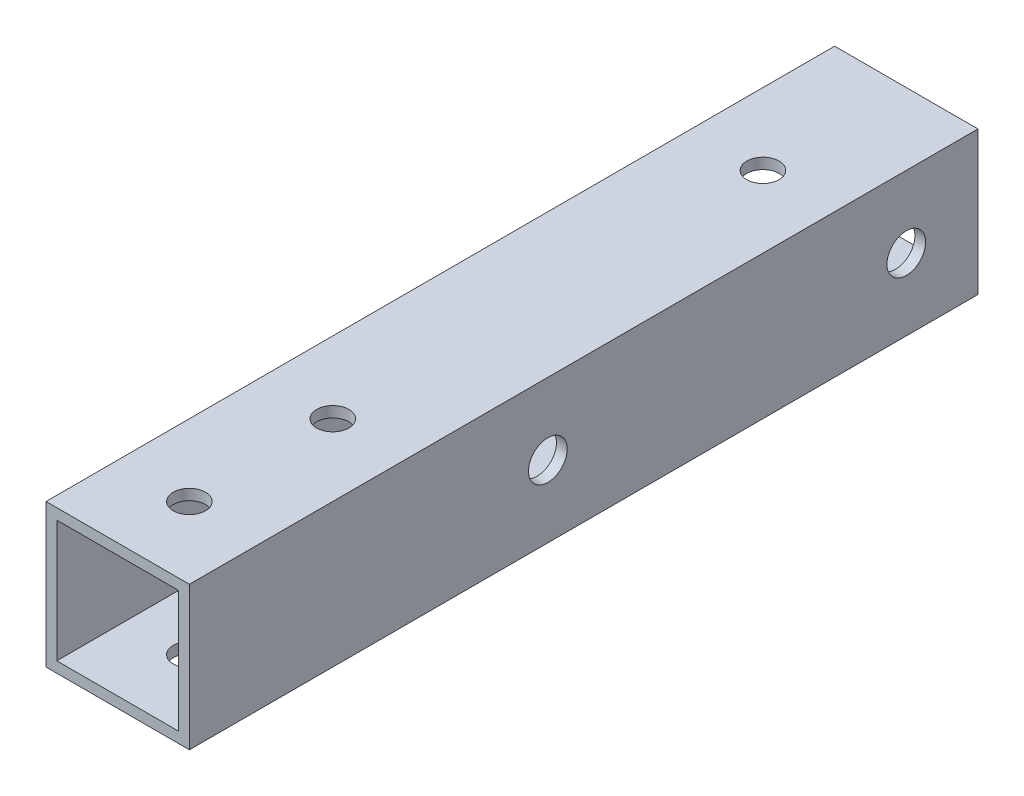
ISO-10303-21;
HEADER;
FILE_DESCRIPTION(('STEP AP214'),'2;1');
FILE_NAME('part.step','',(''),(''),'','','');
FILE_SCHEMA(('AUTOMOTIVE_DESIGN { 1 0 10303 214 1 1 1 1 }'));
ENDSEC;
DATA;
#1=APPLICATION_CONTEXT('core data for automotive mechanical design processes');
#2=APPLICATION_PROTOCOL_DEFINITION('international standard','automotive_design',2000,#1);
#3=PRODUCT_CONTEXT('',#1,'mechanical');
#4=PRODUCT('Part','Part','',(#3));
#5=PRODUCT_RELATED_PRODUCT_CATEGORY('part','',(#4));
#6=PRODUCT_DEFINITION_FORMATION('','',#4);
#7=PRODUCT_DEFINITION_CONTEXT('part definition',#1,'design');
#8=PRODUCT_DEFINITION('design','',#6,#7);
#9=PRODUCT_DEFINITION_SHAPE('','',#8);
#10=(LENGTH_UNIT() NAMED_UNIT(*) SI_UNIT(.MILLI.,.METRE.));
#11=(NAMED_UNIT(*) PLANE_ANGLE_UNIT() SI_UNIT($,.RADIAN.));
#12=(NAMED_UNIT(*) SI_UNIT($,.STERADIAN.) SOLID_ANGLE_UNIT());
#13=UNCERTAINTY_MEASURE_WITH_UNIT(LENGTH_MEASURE(1.E-05),#10,'distance_accuracy_value','');
#14=(GEOMETRIC_REPRESENTATION_CONTEXT(3) GLOBAL_UNCERTAINTY_ASSIGNED_CONTEXT((#13)) GLOBAL_UNIT_ASSIGNED_CONTEXT((#10,
#11,#12)) REPRESENTATION_CONTEXT('',''));
#15=CARTESIAN_POINT('',(0.,0.,0.));
#16=DIRECTION('',(0.,0.,1.));
#17=DIRECTION('',(1.,0.,0.));
#18=AXIS2_PLACEMENT_3D('',#15,#16,#17);
#19=CARTESIAN_POINT('',(0.,0.,110.));
#20=DIRECTION('',(0.,0.,-1.));
#21=DIRECTION('',(-1.,0.,0.));
#22=AXIS2_PLACEMENT_3D('',#19,#20,#21);
#23=PLANE('',#22);
#24=DIRECTION('',(0.,1.,0.));
#25=VECTOR('',#24,1.);
#26=CARTESIAN_POINT('',(10.,-10.,110.));
#27=LINE('',#26,#25);
#28=CARTESIAN_POINT('',(10.,-10.,110.));
#29=VERTEX_POINT('',#28);
#30=CARTESIAN_POINT('',(10.,10.,110.));
#31=VERTEX_POINT('',#30);
#32=EDGE_CURVE('E146',#29,#31,#27,.T.);
#33=ORIENTED_EDGE('',*,*,#32,.T.);
#34=DIRECTION('',(-1.,0.,0.));
#35=VECTOR('',#34,1.);
#36=CARTESIAN_POINT('',(-10.,10.,110.));
#37=LINE('',#36,#35);
#38=CARTESIAN_POINT('',(-10.,10.,110.));
#39=VERTEX_POINT('',#38);
#40=EDGE_CURVE('E149',#31,#39,#37,.T.);
#41=ORIENTED_EDGE('',*,*,#40,.T.);
#42=DIRECTION('',(0.,-1.,0.));
#43=VECTOR('',#42,1.);
#44=CARTESIAN_POINT('',(-10.,-10.,110.));
#45=LINE('',#44,#43);
#46=CARTESIAN_POINT('',(-10.,-10.,110.));
#47=VERTEX_POINT('',#46);
#48=EDGE_CURVE('E152',#39,#47,#45,.T.);
#49=ORIENTED_EDGE('',*,*,#48,.T.);
#50=DIRECTION('',(1.,0.,0.));
#51=VECTOR('',#50,1.);
#52=CARTESIAN_POINT('',(-10.,-10.,110.));
#53=LINE('',#52,#51);
#54=EDGE_CURVE('E154',#47,#29,#53,.T.);
#55=ORIENTED_EDGE('',*,*,#54,.T.);
#56=EDGE_LOOP('',(#33,#41,#49,#55));
#57=FACE_BOUND('',#56,.T.);
#58=DIRECTION('',(0.,1.,0.));
#59=VECTOR('',#58,1.);
#60=CARTESIAN_POINT('',(8.5,-8.5,110.));
#61=LINE('',#60,#59);
#62=CARTESIAN_POINT('',(8.5,-8.5,110.));
#63=VERTEX_POINT('',#62);
#64=CARTESIAN_POINT('',(8.5,8.5,110.));
#65=VERTEX_POINT('',#64);
#66=EDGE_CURVE('E108',#63,#65,#61,.T.);
#67=ORIENTED_EDGE('',*,*,#66,.F.);
#68=DIRECTION('',(1.,0.,0.));
#69=VECTOR('',#68,1.);
#70=CARTESIAN_POINT('',(-8.5,-8.5,110.));
#71=LINE('',#70,#69);
#72=CARTESIAN_POINT('',(-8.5,-8.5,110.));
#73=VERTEX_POINT('',#72);
#74=EDGE_CURVE('E130',#73,#63,#71,.T.);
#75=ORIENTED_EDGE('',*,*,#74,.F.);
#76=DIRECTION('',(0.,-1.,0.));
#77=VECTOR('',#76,1.);
#78=CARTESIAN_POINT('',(-8.5,-8.5,110.));
#79=LINE('',#78,#77);
#80=CARTESIAN_POINT('',(-8.5,8.5,110.));
#81=VERTEX_POINT('',#80);
#82=EDGE_CURVE('E128',#81,#73,#79,.T.);
#83=ORIENTED_EDGE('',*,*,#82,.F.);
#84=DIRECTION('',(-1.,0.,0.));
#85=VECTOR('',#84,1.);
#86=CARTESIAN_POINT('',(-8.5,8.5,110.));
#87=LINE('',#86,#85);
#88=EDGE_CURVE('E116',#65,#81,#87,.T.);
#89=ORIENTED_EDGE('',*,*,#88,.F.);
#90=EDGE_LOOP('',(#67,#75,#83,#89));
#91=FACE_BOUND('',#90,.T.);
#92=ADVANCED_FACE('F41',(#57,#91),#23,.F.);
#93=CARTESIAN_POINT('',(0.,0.,0.));
#94=DIRECTION('',(0.,0.,-1.));
#95=DIRECTION('',(-1.,0.,0.));
#96=AXIS2_PLACEMENT_3D('',#93,#94,#95);
#97=PLANE('',#96);
#98=DIRECTION('',(0.,1.,0.));
#99=VECTOR('',#98,1.);
#100=CARTESIAN_POINT('',(10.,-10.,0.));
#101=LINE('',#100,#99);
#102=CARTESIAN_POINT('',(10.,-10.,0.));
#103=VERTEX_POINT('',#102);
#104=CARTESIAN_POINT('',(10.,10.,0.));
#105=VERTEX_POINT('',#104);
#106=EDGE_CURVE('E124',#103,#105,#101,.T.);
#107=ORIENTED_EDGE('',*,*,#106,.F.);
#108=DIRECTION('',(1.,0.,0.));
#109=VECTOR('',#108,1.);
#110=CARTESIAN_POINT('',(-10.,-10.,0.));
#111=LINE('',#110,#109);
#112=CARTESIAN_POINT('',(-10.,-10.,0.));
#113=VERTEX_POINT('',#112);
#114=EDGE_CURVE('E150',#113,#103,#111,.T.);
#115=ORIENTED_EDGE('',*,*,#114,.F.);
#116=DIRECTION('',(0.,-1.,0.));
#117=VECTOR('',#116,1.);
#118=CARTESIAN_POINT('',(-10.,-10.,0.));
#119=LINE('',#118,#117);
#120=CARTESIAN_POINT('',(-10.,10.,0.));
#121=VERTEX_POINT('',#120);
#122=EDGE_CURVE('E161',#121,#113,#119,.T.);
#123=ORIENTED_EDGE('',*,*,#122,.F.);
#124=DIRECTION('',(-1.,0.,0.));
#125=VECTOR('',#124,1.);
#126=CARTESIAN_POINT('',(-10.,10.,0.));
#127=LINE('',#126,#125);
#128=EDGE_CURVE('E159',#105,#121,#127,.T.);
#129=ORIENTED_EDGE('',*,*,#128,.F.);
#130=EDGE_LOOP('',(#107,#115,#123,#129));
#131=FACE_BOUND('',#130,.T.);
#132=DIRECTION('',(1.,0.,0.));
#133=VECTOR('',#132,1.);
#134=CARTESIAN_POINT('',(-8.5,-8.5,0.));
#135=LINE('',#134,#133);
#136=CARTESIAN_POINT('',(-8.5,-8.5,0.));
#137=VERTEX_POINT('',#136);
#138=CARTESIAN_POINT('',(8.5,-8.5,0.));
#139=VERTEX_POINT('',#138);
#140=EDGE_CURVE('E117',#137,#139,#135,.T.);
#141=ORIENTED_EDGE('',*,*,#140,.T.);
#142=DIRECTION('',(0.,1.,0.));
#143=VECTOR('',#142,1.);
#144=CARTESIAN_POINT('',(8.5,-8.5,0.));
#145=LINE('',#144,#143);
#146=CARTESIAN_POINT('',(8.5,8.5,0.));
#147=VERTEX_POINT('',#146);
#148=EDGE_CURVE('E66',#139,#147,#145,.T.);
#149=ORIENTED_EDGE('',*,*,#148,.T.);
#150=DIRECTION('',(-1.,0.,0.));
#151=VECTOR('',#150,1.);
#152=CARTESIAN_POINT('',(-8.5,8.5,0.));
#153=LINE('',#152,#151);
#154=CARTESIAN_POINT('',(-8.5,8.5,0.));
#155=VERTEX_POINT('',#154);
#156=EDGE_CURVE('E123',#147,#155,#153,.T.);
#157=ORIENTED_EDGE('',*,*,#156,.T.);
#158=DIRECTION('',(0.,-1.,0.));
#159=VECTOR('',#158,1.);
#160=CARTESIAN_POINT('',(-8.5,-8.5,0.));
#161=LINE('',#160,#159);
#162=EDGE_CURVE('E138',#155,#137,#161,.T.);
#163=ORIENTED_EDGE('',*,*,#162,.T.);
#164=EDGE_LOOP('',(#141,#149,#157,#163));
#165=FACE_BOUND('',#164,.T.);
#166=ADVANCED_FACE('F250',(#131,#165),#97,.T.);
#167=CARTESIAN_POINT('',(10.,-10.,110.));
#168=DIRECTION('',(-1.,0.,0.));
#169=DIRECTION('',(0.,0.,1.));
#170=AXIS2_PLACEMENT_3D('',#167,#168,#169);
#171=PLANE('',#170);
#172=CARTESIAN_POINT('',(10.,0.,10.));
#173=DIRECTION('',(1.,0.,0.));
#174=DIRECTION('',(0.,0.,-1.));
#175=AXIS2_PLACEMENT_3D('',#172,#173,#174);
#176=CIRCLE('',#175,2.7);
#177=CARTESIAN_POINT('',(10.,0.,7.3));
#178=VERTEX_POINT('',#177);
#179=EDGE_CURVE('E221',#178,#178,#176,.T.);
#180=ORIENTED_EDGE('',*,*,#179,.F.);
#181=EDGE_LOOP('',(#180));
#182=FACE_BOUND('',#181,.T.);
#183=CARTESIAN_POINT('',(10.,0.,60.));
#184=DIRECTION('',(1.,0.,0.));
#185=DIRECTION('',(0.,0.,-1.));
#186=AXIS2_PLACEMENT_3D('',#183,#184,#185);
#187=CIRCLE('',#186,2.7);
#188=CARTESIAN_POINT('',(10.,0.,57.3));
#189=VERTEX_POINT('',#188);
#190=EDGE_CURVE('E220',#189,#189,#187,.T.);
#191=ORIENTED_EDGE('',*,*,#190,.F.);
#192=EDGE_LOOP('',(#191));
#193=FACE_BOUND('',#192,.T.);
#194=ORIENTED_EDGE('',*,*,#106,.T.);
#195=DIRECTION('',(0.,0.,-1.));
#196=VECTOR('',#195,1.);
#197=CARTESIAN_POINT('',(10.,10.,110.));
#198=LINE('',#197,#196);
#199=EDGE_CURVE('E11',#31,#105,#198,.T.);
#200=ORIENTED_EDGE('',*,*,#199,.F.);
#201=ORIENTED_EDGE('',*,*,#32,.F.);
#202=DIRECTION('',(0.,0.,-1.));
#203=VECTOR('',#202,1.);
#204=CARTESIAN_POINT('',(10.,-10.,110.));
#205=LINE('',#204,#203);
#206=EDGE_CURVE('E156',#29,#103,#205,.T.);
#207=ORIENTED_EDGE('',*,*,#206,.T.);
#208=EDGE_LOOP('',(#194,#200,#201,#207));
#209=FACE_BOUND('',#208,.T.);
#210=ADVANCED_FACE('F43',(#182,#193,#209),#171,.F.);
#211=CARTESIAN_POINT('',(-10.,10.,110.));
#212=DIRECTION('',(0.,-1.,0.));
#213=DIRECTION('',(0.,0.,-1.));
#214=AXIS2_PLACEMENT_3D('',#211,#212,#213);
#215=PLANE('',#214);
#216=CARTESIAN_POINT('',(0.,10.,100.));
#217=DIRECTION('',(0.,1.,0.));
#218=DIRECTION('',(0.,0.,1.));
#219=AXIS2_PLACEMENT_3D('',#216,#217,#218);
#220=CIRCLE('',#219,2.25);
#221=CARTESIAN_POINT('',(0.,10.,102.25));
#222=VERTEX_POINT('',#221);
#223=EDGE_CURVE('E203',#222,#222,#220,.T.);
#224=ORIENTED_EDGE('',*,*,#223,.F.);
#225=EDGE_LOOP('',(#224));
#226=FACE_BOUND('',#225,.T.);
#227=CARTESIAN_POINT('',(0.,10.,80.));
#228=DIRECTION('',(0.,1.,0.));
#229=DIRECTION('',(0.,0.,1.));
#230=AXIS2_PLACEMENT_3D('',#227,#228,#229);
#231=CIRCLE('',#230,2.25);
#232=CARTESIAN_POINT('',(0.,10.,82.25));
#233=VERTEX_POINT('',#232);
#234=EDGE_CURVE('E206',#233,#233,#231,.T.);
#235=ORIENTED_EDGE('',*,*,#234,.F.);
#236=EDGE_LOOP('',(#235));
#237=FACE_BOUND('',#236,.T.);
#238=CARTESIAN_POINT('',(-2.06718869533235E-13,10.,20.));
#239=DIRECTION('',(0.,1.,0.));
#240=DIRECTION('',(0.,0.,1.));
#241=AXIS2_PLACEMENT_3D('',#238,#239,#240);
#242=CIRCLE('',#241,2.25);
#243=CARTESIAN_POINT('',(-2.06718869533235E-13,10.,22.25));
#244=VERTEX_POINT('',#243);
#245=EDGE_CURVE('E182',#244,#244,#242,.T.);
#246=ORIENTED_EDGE('',*,*,#245,.F.);
#247=EDGE_LOOP('',(#246));
#248=FACE_BOUND('',#247,.T.);
#249=ORIENTED_EDGE('',*,*,#128,.T.);
#250=DIRECTION('',(0.,0.,-1.));
#251=VECTOR('',#250,1.);
#252=CARTESIAN_POINT('',(-10.,10.,110.));
#253=LINE('',#252,#251);
#254=EDGE_CURVE('E50',#39,#121,#253,.T.);
#255=ORIENTED_EDGE('',*,*,#254,.F.);
#256=ORIENTED_EDGE('',*,*,#40,.F.);
#257=ORIENTED_EDGE('',*,*,#199,.T.);
#258=EDGE_LOOP('',(#249,#255,#256,#257));
#259=FACE_BOUND('',#258,.T.);
#260=ADVANCED_FACE('F249',(#226,#237,#248,#259),#215,.F.);
#261=CARTESIAN_POINT('',(-10.,-10.,110.));
#262=DIRECTION('',(1.,0.,0.));
#263=DIRECTION('',(0.,0.,-1.));
#264=AXIS2_PLACEMENT_3D('',#261,#262,#263);
#265=PLANE('',#264);
#266=CARTESIAN_POINT('',(-10.,0.,10.));
#267=DIRECTION('',(-1.,0.,0.));
#268=DIRECTION('',(0.,0.,1.));
#269=AXIS2_PLACEMENT_3D('',#266,#267,#268);
#270=CIRCLE('',#269,5.);
#271=CARTESIAN_POINT('',(-10.,0.,15.));
#272=VERTEX_POINT('',#271);
#273=EDGE_CURVE('E186',#272,#272,#270,.T.);
#274=ORIENTED_EDGE('',*,*,#273,.F.);
#275=EDGE_LOOP('',(#274));
#276=FACE_BOUND('',#275,.T.);
#277=CARTESIAN_POINT('',(-10.,0.,60.));
#278=DIRECTION('',(-1.,0.,0.));
#279=DIRECTION('',(0.,0.,1.));
#280=AXIS2_PLACEMENT_3D('',#277,#278,#279);
#281=CIRCLE('',#280,5.);
#282=CARTESIAN_POINT('',(-10.,0.,65.));
#283=VERTEX_POINT('',#282);
#284=EDGE_CURVE('E191',#283,#283,#281,.T.);
#285=ORIENTED_EDGE('',*,*,#284,.F.);
#286=EDGE_LOOP('',(#285));
#287=FACE_BOUND('',#286,.T.);
#288=ORIENTED_EDGE('',*,*,#122,.T.);
#289=DIRECTION('',(0.,0.,-1.));
#290=VECTOR('',#289,1.);
#291=CARTESIAN_POINT('',(-10.,-10.,110.));
#292=LINE('',#291,#290);
#293=EDGE_CURVE('E166',#47,#113,#292,.T.);
#294=ORIENTED_EDGE('',*,*,#293,.F.);
#295=ORIENTED_EDGE('',*,*,#48,.F.);
#296=ORIENTED_EDGE('',*,*,#254,.T.);
#297=EDGE_LOOP('',(#288,#294,#295,#296));
#298=FACE_BOUND('',#297,.T.);
#299=ADVANCED_FACE('F268',(#276,#287,#298),#265,.F.);
#300=CARTESIAN_POINT('',(-10.,-10.,110.));
#301=DIRECTION('',(0.,1.,0.));
#302=DIRECTION('',(0.,0.,1.));
#303=AXIS2_PLACEMENT_3D('',#300,#301,#302);
#304=PLANE('',#303);
#305=CARTESIAN_POINT('',(-5.38458166943201E-12,-10.,20.0000000000006));
#306=DIRECTION('',(0.,-1.,0.));
#307=DIRECTION('',(0.,0.,-1.));
#308=AXIS2_PLACEMENT_3D('',#305,#306,#307);
#309=CIRCLE('',#308,5.);
#310=CARTESIAN_POINT('',(-5.38458166943201E-12,-10.,15.0000000000006));
#311=VERTEX_POINT('',#310);
#312=EDGE_CURVE('E183',#311,#311,#309,.T.);
#313=ORIENTED_EDGE('',*,*,#312,.F.);
#314=EDGE_LOOP('',(#313));
#315=FACE_BOUND('',#314,.T.);
#316=CARTESIAN_POINT('',(0.,-10.,100.));
#317=DIRECTION('',(0.,1.,0.));
#318=DIRECTION('',(0.,0.,1.));
#319=AXIS2_PLACEMENT_3D('',#316,#317,#318);
#320=CIRCLE('',#319,2.25);
#321=CARTESIAN_POINT('',(0.,-10.,102.25));
#322=VERTEX_POINT('',#321);
#323=EDGE_CURVE('E200',#322,#322,#320,.T.);
#324=ORIENTED_EDGE('',*,*,#323,.T.);
#325=EDGE_LOOP('',(#324));
#326=FACE_BOUND('',#325,.T.);
#327=CARTESIAN_POINT('',(0.,-10.,80.));
#328=DIRECTION('',(0.,1.,0.));
#329=DIRECTION('',(0.,0.,1.));
#330=AXIS2_PLACEMENT_3D('',#327,#328,#329);
#331=CIRCLE('',#330,2.25);
#332=CARTESIAN_POINT('',(0.,-10.,82.25));
#333=VERTEX_POINT('',#332);
#334=EDGE_CURVE('E209',#333,#333,#331,.T.);
#335=ORIENTED_EDGE('',*,*,#334,.T.);
#336=EDGE_LOOP('',(#335));
#337=FACE_BOUND('',#336,.T.);
#338=ORIENTED_EDGE('',*,*,#114,.T.);
#339=ORIENTED_EDGE('',*,*,#206,.F.);
#340=ORIENTED_EDGE('',*,*,#54,.F.);
#341=ORIENTED_EDGE('',*,*,#293,.T.);
#342=EDGE_LOOP('',(#338,#339,#340,#341));
#343=FACE_BOUND('',#342,.T.);
#344=ADVANCED_FACE('F236',(#315,#326,#337,#343),#304,.F.);
#345=CARTESIAN_POINT('',(8.5,-8.5,110.));
#346=DIRECTION('',(-1.,0.,0.));
#347=DIRECTION('',(0.,0.,1.));
#348=AXIS2_PLACEMENT_3D('',#345,#346,#347);
#349=PLANE('',#348);
#350=CARTESIAN_POINT('',(8.5,0.,10.));
#351=DIRECTION('',(-1.,0.,0.));
#352=DIRECTION('',(0.,0.,1.));
#353=AXIS2_PLACEMENT_3D('',#350,#351,#352);
#354=CIRCLE('',#353,2.7);
#355=CARTESIAN_POINT('',(8.5,0.,12.7));
#356=VERTEX_POINT('',#355);
#357=EDGE_CURVE('E136',#356,#356,#354,.T.);
#358=ORIENTED_EDGE('',*,*,#357,.F.);
#359=EDGE_LOOP('',(#358));
#360=FACE_BOUND('',#359,.T.);
#361=CARTESIAN_POINT('',(8.5,0.,60.));
#362=DIRECTION('',(-1.,0.,0.));
#363=DIRECTION('',(0.,0.,1.));
#364=AXIS2_PLACEMENT_3D('',#361,#362,#363);
#365=CIRCLE('',#364,2.7);
#366=CARTESIAN_POINT('',(8.5,0.,62.7));
#367=VERTEX_POINT('',#366);
#368=EDGE_CURVE('E224',#367,#367,#365,.T.);
#369=ORIENTED_EDGE('',*,*,#368,.F.);
#370=EDGE_LOOP('',(#369));
#371=FACE_BOUND('',#370,.T.);
#372=ORIENTED_EDGE('',*,*,#148,.F.);
#373=DIRECTION('',(0.,0.,-1.));
#374=VECTOR('',#373,1.);
#375=CARTESIAN_POINT('',(8.5,-8.5,110.));
#376=LINE('',#375,#374);
#377=EDGE_CURVE('E112',#63,#139,#376,.T.);
#378=ORIENTED_EDGE('',*,*,#377,.F.);
#379=ORIENTED_EDGE('',*,*,#66,.T.);
#380=DIRECTION('',(0.,0.,-1.));
#381=VECTOR('',#380,1.);
#382=CARTESIAN_POINT('',(8.5,8.5,110.));
#383=LINE('',#382,#381);
#384=EDGE_CURVE('E111',#65,#147,#383,.T.);
#385=ORIENTED_EDGE('',*,*,#384,.T.);
#386=EDGE_LOOP('',(#372,#378,#379,#385));
#387=FACE_BOUND('',#386,.T.);
#388=ADVANCED_FACE('F110',(#360,#371,#387),#349,.T.);
#389=CARTESIAN_POINT('',(-8.5,8.5,110.));
#390=DIRECTION('',(0.,-1.,0.));
#391=DIRECTION('',(0.,0.,-1.));
#392=AXIS2_PLACEMENT_3D('',#389,#390,#391);
#393=PLANE('',#392);
#394=CARTESIAN_POINT('',(0.,8.5,100.));
#395=DIRECTION('',(0.,-1.,0.));
#396=DIRECTION('',(0.,0.,-1.));
#397=AXIS2_PLACEMENT_3D('',#394,#395,#396);
#398=CIRCLE('',#397,2.25);
#399=CARTESIAN_POINT('',(0.,8.5,97.75));
#400=VERTEX_POINT('',#399);
#401=EDGE_CURVE('E179',#400,#400,#398,.T.);
#402=ORIENTED_EDGE('',*,*,#401,.F.);
#403=EDGE_LOOP('',(#402));
#404=FACE_BOUND('',#403,.T.);
#405=CARTESIAN_POINT('',(0.,8.5,80.));
#406=DIRECTION('',(0.,-1.,0.));
#407=DIRECTION('',(0.,0.,-1.));
#408=AXIS2_PLACEMENT_3D('',#405,#406,#407);
#409=CIRCLE('',#408,2.25);
#410=CARTESIAN_POINT('',(0.,8.5,77.75));
#411=VERTEX_POINT('',#410);
#412=EDGE_CURVE('E174',#411,#411,#409,.T.);
#413=ORIENTED_EDGE('',*,*,#412,.F.);
#414=EDGE_LOOP('',(#413));
#415=FACE_BOUND('',#414,.T.);
#416=CARTESIAN_POINT('',(-2.06718869533235E-13,8.5,20.));
#417=DIRECTION('',(0.,-1.,0.));
#418=DIRECTION('',(0.,0.,-1.));
#419=AXIS2_PLACEMENT_3D('',#416,#417,#418);
#420=CIRCLE('',#419,2.25);
#421=CARTESIAN_POINT('',(-2.06718869533235E-13,8.5,17.75));
#422=VERTEX_POINT('',#421);
#423=EDGE_CURVE('E175',#422,#422,#420,.T.);
#424=ORIENTED_EDGE('',*,*,#423,.F.);
#425=EDGE_LOOP('',(#424));
#426=FACE_BOUND('',#425,.T.);
#427=ORIENTED_EDGE('',*,*,#156,.F.);
#428=ORIENTED_EDGE('',*,*,#384,.F.);
#429=ORIENTED_EDGE('',*,*,#88,.T.);
#430=DIRECTION('',(0.,0.,-1.));
#431=VECTOR('',#430,1.);
#432=CARTESIAN_POINT('',(-8.5,8.5,110.));
#433=LINE('',#432,#431);
#434=EDGE_CURVE('E125',#81,#155,#433,.T.);
#435=ORIENTED_EDGE('',*,*,#434,.T.);
#436=EDGE_LOOP('',(#427,#428,#429,#435));
#437=FACE_BOUND('',#436,.T.);
#438=ADVANCED_FACE('F120',(#404,#415,#426,#437),#393,.T.);
#439=CARTESIAN_POINT('',(-8.5,-8.5,110.));
#440=DIRECTION('',(1.,0.,0.));
#441=DIRECTION('',(0.,0.,-1.));
#442=AXIS2_PLACEMENT_3D('',#439,#440,#441);
#443=PLANE('',#442);
#444=CARTESIAN_POINT('',(-8.5,0.,10.));
#445=DIRECTION('',(1.,0.,0.));
#446=DIRECTION('',(0.,0.,-1.));
#447=AXIS2_PLACEMENT_3D('',#444,#445,#446);
#448=CIRCLE('',#447,5.);
#449=CARTESIAN_POINT('',(-8.5,0.,5.));
#450=VERTEX_POINT('',#449);
#451=EDGE_CURVE('E45',#450,#450,#448,.T.);
#452=ORIENTED_EDGE('',*,*,#451,.F.);
#453=EDGE_LOOP('',(#452));
#454=FACE_BOUND('',#453,.T.);
#455=CARTESIAN_POINT('',(-8.5,0.,60.));
#456=DIRECTION('',(1.,0.,0.));
#457=DIRECTION('',(0.,0.,-1.));
#458=AXIS2_PLACEMENT_3D('',#455,#456,#457);
#459=CIRCLE('',#458,5.);
#460=CARTESIAN_POINT('',(-8.5,0.,55.));
#461=VERTEX_POINT('',#460);
#462=EDGE_CURVE('E184',#461,#461,#459,.T.);
#463=ORIENTED_EDGE('',*,*,#462,.F.);
#464=EDGE_LOOP('',(#463));
#465=FACE_BOUND('',#464,.T.);
#466=ORIENTED_EDGE('',*,*,#162,.F.);
#467=ORIENTED_EDGE('',*,*,#434,.F.);
#468=ORIENTED_EDGE('',*,*,#82,.T.);
#469=DIRECTION('',(0.,0.,-1.));
#470=VECTOR('',#469,1.);
#471=CARTESIAN_POINT('',(-8.5,-8.5,110.));
#472=LINE('',#471,#470);
#473=EDGE_CURVE('E58',#73,#137,#472,.T.);
#474=ORIENTED_EDGE('',*,*,#473,.T.);
#475=EDGE_LOOP('',(#466,#467,#468,#474));
#476=FACE_BOUND('',#475,.T.);
#477=ADVANCED_FACE('F291',(#454,#465,#476),#443,.T.);
#478=CARTESIAN_POINT('',(-8.5,-8.5,110.));
#479=DIRECTION('',(0.,1.,0.));
#480=DIRECTION('',(0.,0.,1.));
#481=AXIS2_PLACEMENT_3D('',#478,#479,#480);
#482=PLANE('',#481);
#483=CARTESIAN_POINT('',(-5.38458166943201E-12,-8.5,20.0000000000006));
#484=DIRECTION('',(0.,1.,0.));
#485=DIRECTION('',(0.,0.,1.));
#486=AXIS2_PLACEMENT_3D('',#483,#484,#485);
#487=CIRCLE('',#486,5.);
#488=CARTESIAN_POINT('',(-5.38458166943201E-12,-8.5,25.0000000000006));
#489=VERTEX_POINT('',#488);
#490=EDGE_CURVE('E180',#489,#489,#487,.T.);
#491=ORIENTED_EDGE('',*,*,#490,.F.);
#492=EDGE_LOOP('',(#491));
#493=FACE_BOUND('',#492,.T.);
#494=CARTESIAN_POINT('',(0.,-8.5,100.));
#495=DIRECTION('',(0.,1.,0.));
#496=DIRECTION('',(0.,0.,1.));
#497=AXIS2_PLACEMENT_3D('',#494,#495,#496);
#498=CIRCLE('',#497,2.25);
#499=CARTESIAN_POINT('',(0.,-8.5,102.25));
#500=VERTEX_POINT('',#499);
#501=EDGE_CURVE('E176',#500,#500,#498,.T.);
#502=ORIENTED_EDGE('',*,*,#501,.F.);
#503=EDGE_LOOP('',(#502));
#504=FACE_BOUND('',#503,.T.);
#505=CARTESIAN_POINT('',(0.,-8.5,80.));
#506=DIRECTION('',(0.,1.,0.));
#507=DIRECTION('',(0.,0.,1.));
#508=AXIS2_PLACEMENT_3D('',#505,#506,#507);
#509=CIRCLE('',#508,2.25);
#510=CARTESIAN_POINT('',(0.,-8.5,82.25));
#511=VERTEX_POINT('',#510);
#512=EDGE_CURVE('E171',#511,#511,#509,.T.);
#513=ORIENTED_EDGE('',*,*,#512,.F.);
#514=EDGE_LOOP('',(#513));
#515=FACE_BOUND('',#514,.T.);
#516=ORIENTED_EDGE('',*,*,#140,.F.);
#517=ORIENTED_EDGE('',*,*,#473,.F.);
#518=ORIENTED_EDGE('',*,*,#74,.T.);
#519=ORIENTED_EDGE('',*,*,#377,.T.);
#520=EDGE_LOOP('',(#516,#517,#518,#519));
#521=FACE_BOUND('',#520,.T.);
#522=ADVANCED_FACE('F243',(#493,#504,#515,#521),#482,.T.);
#523=CARTESIAN_POINT('',(-15.,0.,60.));
#524=DIRECTION('',(1.,0.,0.));
#525=DIRECTION('',(0.,0.,-1.));
#526=AXIS2_PLACEMENT_3D('',#523,#524,#525);
#527=CYLINDRICAL_SURFACE('',#526,2.7);
#528=ORIENTED_EDGE('',*,*,#368,.T.);
#529=EDGE_LOOP('',(#528));
#530=FACE_BOUND('',#529,.T.);
#531=ORIENTED_EDGE('',*,*,#190,.T.);
#532=EDGE_LOOP('',(#531));
#533=FACE_BOUND('',#532,.T.);
#534=ADVANCED_FACE('F240',(#530,#533),#527,.F.);
#535=CARTESIAN_POINT('',(-15.,0.,10.));
#536=DIRECTION('',(1.,0.,0.));
#537=DIRECTION('',(0.,0.,-1.));
#538=AXIS2_PLACEMENT_3D('',#535,#536,#537);
#539=CYLINDRICAL_SURFACE('',#538,2.7);
#540=ORIENTED_EDGE('',*,*,#357,.T.);
#541=EDGE_LOOP('',(#540));
#542=FACE_BOUND('',#541,.T.);
#543=ORIENTED_EDGE('',*,*,#179,.T.);
#544=EDGE_LOOP('',(#543));
#545=FACE_BOUND('',#544,.T.);
#546=ADVANCED_FACE('F231',(#542,#545),#539,.F.);
#547=CARTESIAN_POINT('',(0.,-10.,80.));
#548=DIRECTION('',(0.,1.,0.));
#549=DIRECTION('',(0.,0.,1.));
#550=AXIS2_PLACEMENT_3D('',#547,#548,#549);
#551=CYLINDRICAL_SURFACE('',#550,2.25);
#552=ORIENTED_EDGE('',*,*,#512,.T.);
#553=EDGE_LOOP('',(#552));
#554=FACE_BOUND('',#553,.T.);
#555=ORIENTED_EDGE('',*,*,#334,.F.);
#556=EDGE_LOOP('',(#555));
#557=FACE_BOUND('',#556,.T.);
#558=ADVANCED_FACE('F300',(#554,#557),#551,.F.);
#559=CARTESIAN_POINT('',(0.,-10.,100.));
#560=DIRECTION('',(0.,1.,0.));
#561=DIRECTION('',(0.,0.,1.));
#562=AXIS2_PLACEMENT_3D('',#559,#560,#561);
#563=CYLINDRICAL_SURFACE('',#562,2.25);
#564=ORIENTED_EDGE('',*,*,#501,.T.);
#565=EDGE_LOOP('',(#564));
#566=FACE_BOUND('',#565,.T.);
#567=ORIENTED_EDGE('',*,*,#323,.F.);
#568=EDGE_LOOP('',(#567));
#569=FACE_BOUND('',#568,.T.);
#570=ADVANCED_FACE('F305',(#566,#569),#563,.F.);
#571=CARTESIAN_POINT('',(-2.06718869533235E-13,-10.,20.));
#572=DIRECTION('',(0.,1.,0.));
#573=DIRECTION('',(0.,0.,1.));
#574=AXIS2_PLACEMENT_3D('',#571,#572,#573);
#575=CYLINDRICAL_SURFACE('',#574,2.25);
#576=ORIENTED_EDGE('',*,*,#423,.T.);
#577=EDGE_LOOP('',(#576));
#578=FACE_BOUND('',#577,.T.);
#579=ORIENTED_EDGE('',*,*,#245,.T.);
#580=EDGE_LOOP('',(#579));
#581=FACE_BOUND('',#580,.T.);
#582=ADVANCED_FACE('F301',(#578,#581),#575,.F.);
#583=ORIENTED_EDGE('',*,*,#412,.T.);
#584=EDGE_LOOP('',(#583));
#585=FACE_BOUND('',#584,.T.);
#586=ORIENTED_EDGE('',*,*,#234,.T.);
#587=EDGE_LOOP('',(#586));
#588=FACE_BOUND('',#587,.T.);
#589=ADVANCED_FACE('F304',(#585,#588),#551,.F.);
#590=ORIENTED_EDGE('',*,*,#401,.T.);
#591=EDGE_LOOP('',(#590));
#592=FACE_BOUND('',#591,.T.);
#593=ORIENTED_EDGE('',*,*,#223,.T.);
#594=EDGE_LOOP('',(#593));
#595=FACE_BOUND('',#594,.T.);
#596=ADVANCED_FACE('F313',(#592,#595),#563,.F.);
#597=CARTESIAN_POINT('',(-5.38458166943201E-12,0.,20.0000000000006));
#598=DIRECTION('',(0.,-1.,0.));
#599=DIRECTION('',(0.,0.,-1.));
#600=AXIS2_PLACEMENT_3D('',#597,#598,#599);
#601=CYLINDRICAL_SURFACE('',#600,5.);
#602=ORIENTED_EDGE('',*,*,#490,.T.);
#603=EDGE_LOOP('',(#602));
#604=FACE_BOUND('',#603,.T.);
#605=ORIENTED_EDGE('',*,*,#312,.T.);
#606=EDGE_LOOP('',(#605));
#607=FACE_BOUND('',#606,.T.);
#608=ADVANCED_FACE('F314',(#604,#607),#601,.F.);
#609=CARTESIAN_POINT('',(0.,0.,60.));
#610=DIRECTION('',(-1.,0.,0.));
#611=DIRECTION('',(0.,0.,1.));
#612=AXIS2_PLACEMENT_3D('',#609,#610,#611);
#613=CYLINDRICAL_SURFACE('',#612,5.);
#614=ORIENTED_EDGE('',*,*,#462,.T.);
#615=EDGE_LOOP('',(#614));
#616=FACE_BOUND('',#615,.T.);
#617=ORIENTED_EDGE('',*,*,#284,.T.);
#618=EDGE_LOOP('',(#617));
#619=FACE_BOUND('',#618,.T.);
#620=ADVANCED_FACE('F316',(#616,#619),#613,.F.);
#621=CARTESIAN_POINT('',(0.,0.,10.));
#622=DIRECTION('',(-1.,0.,0.));
#623=DIRECTION('',(0.,0.,1.));
#624=AXIS2_PLACEMENT_3D('',#621,#622,#623);
#625=CYLINDRICAL_SURFACE('',#624,5.);
#626=ORIENTED_EDGE('',*,*,#451,.T.);
#627=EDGE_LOOP('',(#626));
#628=FACE_BOUND('',#627,.T.);
#629=ORIENTED_EDGE('',*,*,#273,.T.);
#630=EDGE_LOOP('',(#629));
#631=FACE_BOUND('',#630,.T.);
#632=ADVANCED_FACE('F320',(#628,#631),#625,.F.);
#633=CLOSED_SHELL('',(#92,#166,#210,#260,#299,#344,#388,#438,#477,#522,#534,#546,#558,#570,#582,
#589,#596,#608,#620,#632));
#634=MANIFOLD_SOLID_BREP('B2',#633);
#635=ADVANCED_BREP_SHAPE_REPRESENTATION('',(#18,#634),#14);
#636=SHAPE_DEFINITION_REPRESENTATION(#9,#635);
ENDSEC;
END-ISO-10303-21;
